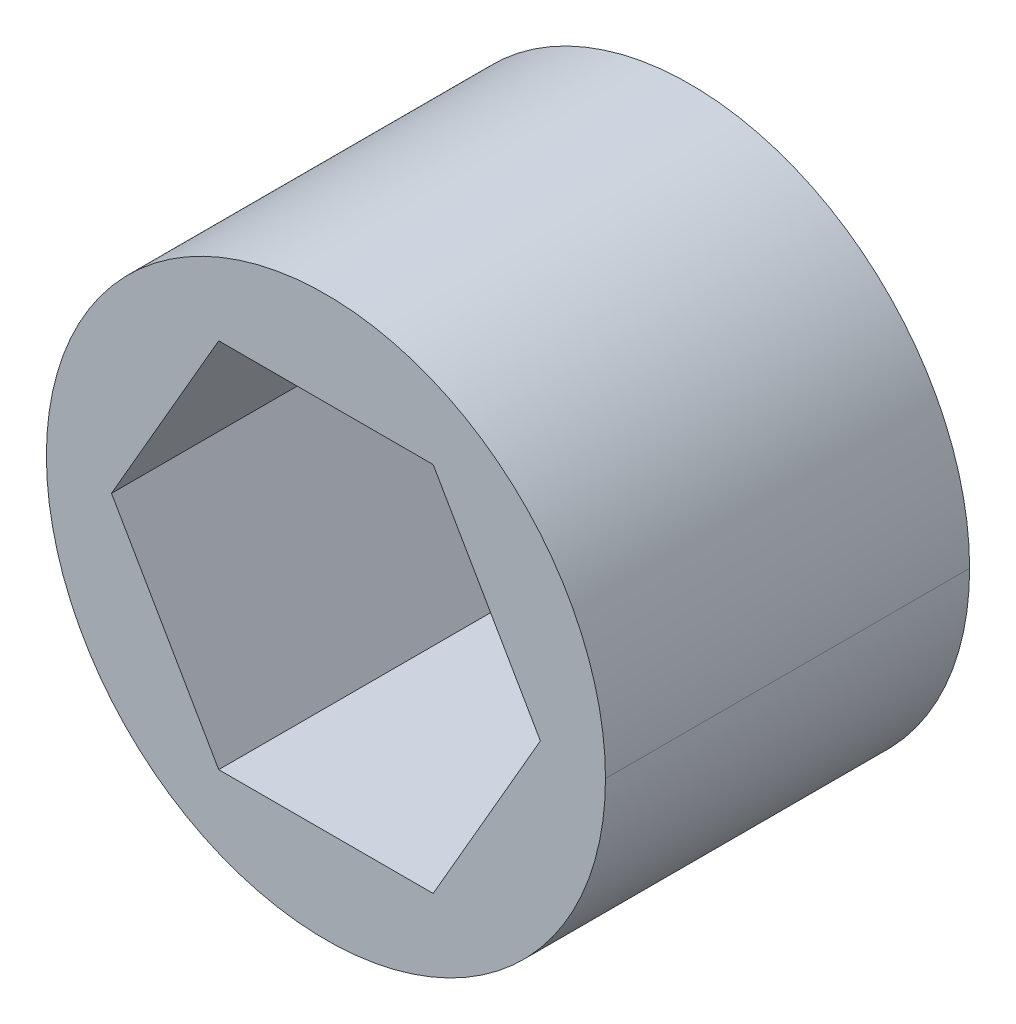
ISO-10303-21;
HEADER;
FILE_DESCRIPTION(('STEP AP214'),'2;1');
FILE_NAME('part.step','',(''),(''),'','','');
FILE_SCHEMA(('AUTOMOTIVE_DESIGN { 1 0 10303 214 1 1 1 1 }'));
ENDSEC;
DATA;
#1=APPLICATION_CONTEXT('core data for automotive mechanical design processes');
#2=APPLICATION_PROTOCOL_DEFINITION('international standard','automotive_design',2000,#1);
#3=PRODUCT_CONTEXT('',#1,'mechanical');
#4=PRODUCT('Part','Part','',(#3));
#5=PRODUCT_RELATED_PRODUCT_CATEGORY('part','',(#4));
#6=PRODUCT_DEFINITION_FORMATION('','',#4);
#7=PRODUCT_DEFINITION_CONTEXT('part definition',#1,'design');
#8=PRODUCT_DEFINITION('design','',#6,#7);
#9=PRODUCT_DEFINITION_SHAPE('','',#8);
#10=(LENGTH_UNIT() NAMED_UNIT(*) SI_UNIT(.MILLI.,.METRE.));
#11=(NAMED_UNIT(*) PLANE_ANGLE_UNIT() SI_UNIT($,.RADIAN.));
#12=(NAMED_UNIT(*) SI_UNIT($,.STERADIAN.) SOLID_ANGLE_UNIT());
#13=UNCERTAINTY_MEASURE_WITH_UNIT(LENGTH_MEASURE(1.E-05),#10,'distance_accuracy_value','');
#14=(GEOMETRIC_REPRESENTATION_CONTEXT(3) GLOBAL_UNCERTAINTY_ASSIGNED_CONTEXT((#13)) GLOBAL_UNIT_ASSIGNED_CONTEXT((#10,
#11,#12)) REPRESENTATION_CONTEXT('',''));
#15=CARTESIAN_POINT('',(0.,0.,0.));
#16=DIRECTION('',(0.,0.,1.));
#17=DIRECTION('',(1.,0.,0.));
#18=AXIS2_PLACEMENT_3D('',#15,#16,#17);
#19=CARTESIAN_POINT('',(-7.47899538708241,0.,6.35));
#20=DIRECTION('',(0.866025403784439,0.5,0.));
#21=DIRECTION('',(0.,0.,-1.));
#22=AXIS2_PLACEMENT_3D('',#19,#20,#21);
#23=PLANE('',#22);
#24=DIRECTION('',(-0.5,0.866025403784439,0.));
#25=VECTOR('',#24,1.);
#26=CARTESIAN_POINT('',(-3.7394976935412,-6.477,6.35));
#27=LINE('',#26,#25);
#28=CARTESIAN_POINT('',(-3.7394976935412,-6.477,6.35));
#29=VERTEX_POINT('',#28);
#30=CARTESIAN_POINT('',(-7.47899538708241,0.,6.35));
#31=VERTEX_POINT('',#30);
#32=EDGE_CURVE('E153',#29,#31,#27,.T.);
#33=ORIENTED_EDGE('',*,*,#32,.F.);
#34=DIRECTION('',(0.,0.,1.));
#35=VECTOR('',#34,1.);
#36=CARTESIAN_POINT('',(-3.73949769354121,-6.477,6.35));
#37=LINE('',#36,#35);
#38=CARTESIAN_POINT('',(-3.7394976935412,-6.477,-6.35));
#39=VERTEX_POINT('',#38);
#40=EDGE_CURVE('E69',#39,#29,#37,.T.);
#41=ORIENTED_EDGE('',*,*,#40,.F.);
#42=DIRECTION('',(-0.5,0.866025403784439,0.));
#43=VECTOR('',#42,1.);
#44=CARTESIAN_POINT('',(-3.73949769354121,-6.477,-6.35));
#45=LINE('',#44,#43);
#46=CARTESIAN_POINT('',(-7.47899538708241,0.,-6.35));
#47=VERTEX_POINT('',#46);
#48=EDGE_CURVE('E148',#39,#47,#45,.T.);
#49=ORIENTED_EDGE('',*,*,#48,.T.);
#50=DIRECTION('',(0.,0.,-1.));
#51=VECTOR('',#50,1.);
#52=CARTESIAN_POINT('',(-7.47899538708241,0.,6.35));
#53=LINE('',#52,#51);
#54=EDGE_CURVE('E11',#31,#47,#53,.T.);
#55=ORIENTED_EDGE('',*,*,#54,.F.);
#56=EDGE_LOOP('',(#33,#41,#49,#55));
#57=FACE_BOUND('',#56,.T.);
#58=ADVANCED_FACE('F16',(#57),#23,.T.);
#59=CARTESIAN_POINT('',(-3.73949769354121,6.477,6.35));
#60=DIRECTION('',(0.866025403784439,-0.5,0.));
#61=DIRECTION('',(0.,0.,-1.));
#62=AXIS2_PLACEMENT_3D('',#59,#60,#61);
#63=PLANE('',#62);
#64=DIRECTION('',(0.5,0.866025403784439,0.));
#65=VECTOR('',#64,1.);
#66=CARTESIAN_POINT('',(-7.47899538708242,0.,6.35));
#67=LINE('',#66,#65);
#68=CARTESIAN_POINT('',(-3.73949769354121,6.477,6.35));
#69=VERTEX_POINT('',#68);
#70=EDGE_CURVE('E20',#31,#69,#67,.T.);
#71=ORIENTED_EDGE('',*,*,#70,.F.);
#72=ORIENTED_EDGE('',*,*,#54,.T.);
#73=DIRECTION('',(0.5,0.866025403784439,0.));
#74=VECTOR('',#73,1.);
#75=CARTESIAN_POINT('',(-7.47899538708241,0.,-6.35));
#76=LINE('',#75,#74);
#77=CARTESIAN_POINT('',(-3.73949769354121,6.477,-6.35));
#78=VERTEX_POINT('',#77);
#79=EDGE_CURVE('E145',#47,#78,#76,.T.);
#80=ORIENTED_EDGE('',*,*,#79,.T.);
#81=DIRECTION('',(0.,0.,-1.));
#82=VECTOR('',#81,1.);
#83=CARTESIAN_POINT('',(-3.73949769354121,6.477,6.35));
#84=LINE('',#83,#82);
#85=EDGE_CURVE('E27',#69,#78,#84,.T.);
#86=ORIENTED_EDGE('',*,*,#85,.F.);
#87=EDGE_LOOP('',(#71,#72,#80,#86));
#88=FACE_BOUND('',#87,.T.);
#89=ADVANCED_FACE('F217',(#88),#63,.T.);
#90=CARTESIAN_POINT('',(3.7394976935412,6.477,6.35));
#91=DIRECTION('',(0.,-1.,0.));
#92=DIRECTION('',(0.,0.,-1.));
#93=AXIS2_PLACEMENT_3D('',#90,#91,#92);
#94=PLANE('',#93);
#95=DIRECTION('',(1.,0.,0.));
#96=VECTOR('',#95,1.);
#97=CARTESIAN_POINT('',(0.,6.477,6.35));
#98=LINE('',#97,#96);
#99=CARTESIAN_POINT('',(3.7394976935412,6.477,6.35));
#100=VERTEX_POINT('',#99);
#101=EDGE_CURVE('E164',#69,#100,#98,.T.);
#102=ORIENTED_EDGE('',*,*,#101,.F.);
#103=ORIENTED_EDGE('',*,*,#85,.T.);
#104=DIRECTION('',(1.,0.,0.));
#105=VECTOR('',#104,1.);
#106=CARTESIAN_POINT('',(0.,6.477,-6.35));
#107=LINE('',#106,#105);
#108=CARTESIAN_POINT('',(3.7394976935412,6.477,-6.35));
#109=VERTEX_POINT('',#108);
#110=EDGE_CURVE('E144',#78,#109,#107,.T.);
#111=ORIENTED_EDGE('',*,*,#110,.T.);
#112=DIRECTION('',(0.,0.,-1.));
#113=VECTOR('',#112,1.);
#114=CARTESIAN_POINT('',(3.7394976935412,6.477,6.35));
#115=LINE('',#114,#113);
#116=EDGE_CURVE('E139',#100,#109,#115,.T.);
#117=ORIENTED_EDGE('',*,*,#116,.F.);
#118=EDGE_LOOP('',(#102,#103,#111,#117));
#119=FACE_BOUND('',#118,.T.);
#120=ADVANCED_FACE('F200',(#119),#94,.T.);
#121=CARTESIAN_POINT('',(7.47899538708241,0.,6.35));
#122=DIRECTION('',(-0.866025403784439,-0.5,0.));
#123=DIRECTION('',(-0.5,0.866025403784439,0.));
#124=AXIS2_PLACEMENT_3D('',#121,#122,#123);
#125=PLANE('',#124);
#126=DIRECTION('',(0.5,-0.866025403784439,0.));
#127=VECTOR('',#126,1.);
#128=CARTESIAN_POINT('',(3.7394976935412,6.477,6.35));
#129=LINE('',#128,#127);
#130=CARTESIAN_POINT('',(7.47899538708242,0.,6.35));
#131=VERTEX_POINT('',#130);
#132=EDGE_CURVE('E161',#100,#131,#129,.T.);
#133=ORIENTED_EDGE('',*,*,#132,.F.);
#134=ORIENTED_EDGE('',*,*,#116,.T.);
#135=DIRECTION('',(0.5,-0.866025403784439,0.));
#136=VECTOR('',#135,1.);
#137=CARTESIAN_POINT('',(3.7394976935412,6.477,-6.35));
#138=LINE('',#137,#136);
#139=CARTESIAN_POINT('',(7.47899538708241,0.,-6.35));
#140=VERTEX_POINT('',#139);
#141=EDGE_CURVE('E140',#109,#140,#138,.T.);
#142=ORIENTED_EDGE('',*,*,#141,.T.);
#143=DIRECTION('',(0.,0.,-1.));
#144=VECTOR('',#143,1.);
#145=CARTESIAN_POINT('',(7.47899538708242,0.,6.35));
#146=LINE('',#145,#144);
#147=EDGE_CURVE('E171',#131,#140,#146,.T.);
#148=ORIENTED_EDGE('',*,*,#147,.F.);
#149=EDGE_LOOP('',(#133,#134,#142,#148));
#150=FACE_BOUND('',#149,.T.);
#151=ADVANCED_FACE('F206',(#150),#125,.T.);
#152=CARTESIAN_POINT('',(3.7394976935412,-6.477,6.35));
#153=DIRECTION('',(-0.866025403784439,0.5,0.));
#154=DIRECTION('',(0.,0.,1.));
#155=AXIS2_PLACEMENT_3D('',#152,#153,#154);
#156=PLANE('',#155);
#157=DIRECTION('',(-0.5,-0.866025403784439,0.));
#158=VECTOR('',#157,1.);
#159=CARTESIAN_POINT('',(7.47899538708241,0.,6.35));
#160=LINE('',#159,#158);
#161=CARTESIAN_POINT('',(3.73949769354121,-6.477,6.35));
#162=VERTEX_POINT('',#161);
#163=EDGE_CURVE('E154',#131,#162,#160,.T.);
#164=ORIENTED_EDGE('',*,*,#163,.F.);
#165=ORIENTED_EDGE('',*,*,#147,.T.);
#166=DIRECTION('',(-0.5,-0.866025403784439,0.));
#167=VECTOR('',#166,1.);
#168=CARTESIAN_POINT('',(7.47899538708241,0.,-6.35));
#169=LINE('',#168,#167);
#170=CARTESIAN_POINT('',(3.73949769354121,-6.477,-6.35));
#171=VERTEX_POINT('',#170);
#172=EDGE_CURVE('E119',#140,#171,#169,.T.);
#173=ORIENTED_EDGE('',*,*,#172,.T.);
#174=DIRECTION('',(0.,0.,-1.));
#175=VECTOR('',#174,1.);
#176=CARTESIAN_POINT('',(3.7394976935412,-6.477,6.35));
#177=LINE('',#176,#175);
#178=EDGE_CURVE('E155',#162,#171,#177,.T.);
#179=ORIENTED_EDGE('',*,*,#178,.F.);
#180=EDGE_LOOP('',(#164,#165,#173,#179));
#181=FACE_BOUND('',#180,.T.);
#182=ADVANCED_FACE('F210',(#181),#156,.T.);
#183=CARTESIAN_POINT('',(-3.7394976935412,-6.477,6.35));
#184=DIRECTION('',(0.,1.,0.));
#185=DIRECTION('',(1.,0.,0.));
#186=AXIS2_PLACEMENT_3D('',#183,#184,#185);
#187=PLANE('',#186);
#188=DIRECTION('',(-1.,0.,0.));
#189=VECTOR('',#188,1.);
#190=CARTESIAN_POINT('',(0.,-6.477,6.35));
#191=LINE('',#190,#189);
#192=EDGE_CURVE('E149',#162,#29,#191,.T.);
#193=ORIENTED_EDGE('',*,*,#192,.F.);
#194=ORIENTED_EDGE('',*,*,#178,.T.);
#195=DIRECTION('',(-1.,0.,0.));
#196=VECTOR('',#195,1.);
#197=CARTESIAN_POINT('',(0.,-6.477,-6.35));
#198=LINE('',#197,#196);
#199=EDGE_CURVE('E160',#171,#39,#198,.T.);
#200=ORIENTED_EDGE('',*,*,#199,.T.);
#201=ORIENTED_EDGE('',*,*,#40,.T.);
#202=EDGE_LOOP('',(#193,#194,#200,#201));
#203=FACE_BOUND('',#202,.T.);
#204=ADVANCED_FACE('F213',(#203),#187,.T.);
#205=CARTESIAN_POINT('',(0.,0.,6.35));
#206=DIRECTION('',(0.,0.,1.));
#207=DIRECTION('',(1.,0.,0.));
#208=AXIS2_PLACEMENT_3D('',#205,#206,#207);
#209=PLANE('',#208);
#210=ORIENTED_EDGE('',*,*,#101,.T.);
#211=ORIENTED_EDGE('',*,*,#132,.T.);
#212=ORIENTED_EDGE('',*,*,#163,.T.);
#213=ORIENTED_EDGE('',*,*,#192,.T.);
#214=ORIENTED_EDGE('',*,*,#32,.T.);
#215=ORIENTED_EDGE('',*,*,#70,.T.);
#216=EDGE_LOOP('',(#210,#211,#212,#213,#214,#215));
#217=FACE_BOUND('',#216,.T.);
#218=CARTESIAN_POINT('',(0.,0.,6.35));
#219=DIRECTION('',(0.,0.,-1.));
#220=DIRECTION('',(-1.,0.,0.));
#221=AXIS2_PLACEMENT_3D('',#218,#219,#220);
#222=CIRCLE('',#221,9.75);
#223=CARTESIAN_POINT('',(-9.75,0.,6.35));
#224=VERTEX_POINT('',#223);
#225=CARTESIAN_POINT('',(9.75,0.,6.35));
#226=VERTEX_POINT('',#225);
#227=EDGE_CURVE('E129',#224,#226,#222,.T.);
#228=ORIENTED_EDGE('',*,*,#227,.F.);
#229=CARTESIAN_POINT('',(0.,0.,6.35));
#230=DIRECTION('',(0.,0.,-1.));
#231=DIRECTION('',(-1.,0.,0.));
#232=AXIS2_PLACEMENT_3D('',#229,#230,#231);
#233=CIRCLE('',#232,9.75);
#234=EDGE_CURVE('E120',#226,#224,#233,.T.);
#235=ORIENTED_EDGE('',*,*,#234,.F.);
#236=EDGE_LOOP('',(#228,#235));
#237=FACE_BOUND('',#236,.T.);
#238=ADVANCED_FACE('F18',(#217,#237),#209,.T.);
#239=CARTESIAN_POINT('',(0.,0.,-6.35));
#240=DIRECTION('',(0.,0.,1.));
#241=DIRECTION('',(1.,0.,0.));
#242=AXIS2_PLACEMENT_3D('',#239,#240,#241);
#243=PLANE('',#242);
#244=ORIENTED_EDGE('',*,*,#172,.F.);
#245=ORIENTED_EDGE('',*,*,#141,.F.);
#246=ORIENTED_EDGE('',*,*,#110,.F.);
#247=ORIENTED_EDGE('',*,*,#79,.F.);
#248=ORIENTED_EDGE('',*,*,#48,.F.);
#249=ORIENTED_EDGE('',*,*,#199,.F.);
#250=EDGE_LOOP('',(#244,#245,#246,#247,#248,#249));
#251=FACE_BOUND('',#250,.T.);
#252=CARTESIAN_POINT('',(0.,0.,-6.35));
#253=DIRECTION('',(0.,0.,1.));
#254=DIRECTION('',(-1.,0.,0.));
#255=AXIS2_PLACEMENT_3D('',#252,#253,#254);
#256=CIRCLE('',#255,9.75);
#257=CARTESIAN_POINT('',(-9.75,0.,-6.35));
#258=VERTEX_POINT('',#257);
#259=CARTESIAN_POINT('',(9.75,0.,-6.35));
#260=VERTEX_POINT('',#259);
#261=EDGE_CURVE('E108',#258,#260,#256,.T.);
#262=ORIENTED_EDGE('',*,*,#261,.F.);
#263=CARTESIAN_POINT('',(0.,0.,-6.35));
#264=DIRECTION('',(0.,0.,1.));
#265=DIRECTION('',(-1.,0.,0.));
#266=AXIS2_PLACEMENT_3D('',#263,#264,#265);
#267=CIRCLE('',#266,9.75);
#268=EDGE_CURVE('E122',#260,#258,#267,.T.);
#269=ORIENTED_EDGE('',*,*,#268,.F.);
#270=EDGE_LOOP('',(#262,#269));
#271=FACE_BOUND('',#270,.T.);
#272=ADVANCED_FACE('F123',(#251,#271),#243,.F.);
#273=CARTESIAN_POINT('',(0.,0.,6.35));
#274=DIRECTION('',(0.,0.,-1.));
#275=DIRECTION('',(-1.,0.,0.));
#276=AXIS2_PLACEMENT_3D('',#273,#274,#275);
#277=CYLINDRICAL_SURFACE('',#276,9.75);
#278=DIRECTION('',(0.,0.,-1.));
#279=VECTOR('',#278,1.);
#280=CARTESIAN_POINT('',(9.75,0.,6.35));
#281=LINE('',#280,#279);
#282=EDGE_CURVE('E112',#226,#260,#281,.T.);
#283=ORIENTED_EDGE('',*,*,#282,.F.);
#284=ORIENTED_EDGE('',*,*,#234,.T.);
#285=DIRECTION('',(0.,0.,-1.));
#286=VECTOR('',#285,1.);
#287=CARTESIAN_POINT('',(-9.75,0.,6.35));
#288=LINE('',#287,#286);
#289=EDGE_CURVE('E115',#224,#258,#288,.T.);
#290=ORIENTED_EDGE('',*,*,#289,.T.);
#291=ORIENTED_EDGE('',*,*,#261,.T.);
#292=EDGE_LOOP('',(#283,#284,#290,#291));
#293=FACE_BOUND('',#292,.T.);
#294=ADVANCED_FACE('F110',(#293),#277,.T.);
#295=CARTESIAN_POINT('',(0.,0.,6.35));
#296=DIRECTION('',(0.,0.,-1.));
#297=DIRECTION('',(-1.,0.,0.));
#298=AXIS2_PLACEMENT_3D('',#295,#296,#297);
#299=CYLINDRICAL_SURFACE('',#298,9.75);
#300=ORIENTED_EDGE('',*,*,#227,.T.);
#301=ORIENTED_EDGE('',*,*,#282,.T.);
#302=ORIENTED_EDGE('',*,*,#268,.T.);
#303=ORIENTED_EDGE('',*,*,#289,.F.);
#304=EDGE_LOOP('',(#300,#301,#302,#303));
#305=FACE_BOUND('',#304,.T.);
#306=ADVANCED_FACE('F127',(#305),#299,.T.);
#307=CLOSED_SHELL('',(#58,#89,#120,#151,#182,#204,#238,#272,#294,#306));
#308=MANIFOLD_SOLID_BREP('B1',#307);
#309=ADVANCED_BREP_SHAPE_REPRESENTATION('',(#18,#308),#14);
#310=SHAPE_DEFINITION_REPRESENTATION(#9,#309);
ENDSEC;
END-ISO-10303-21;
